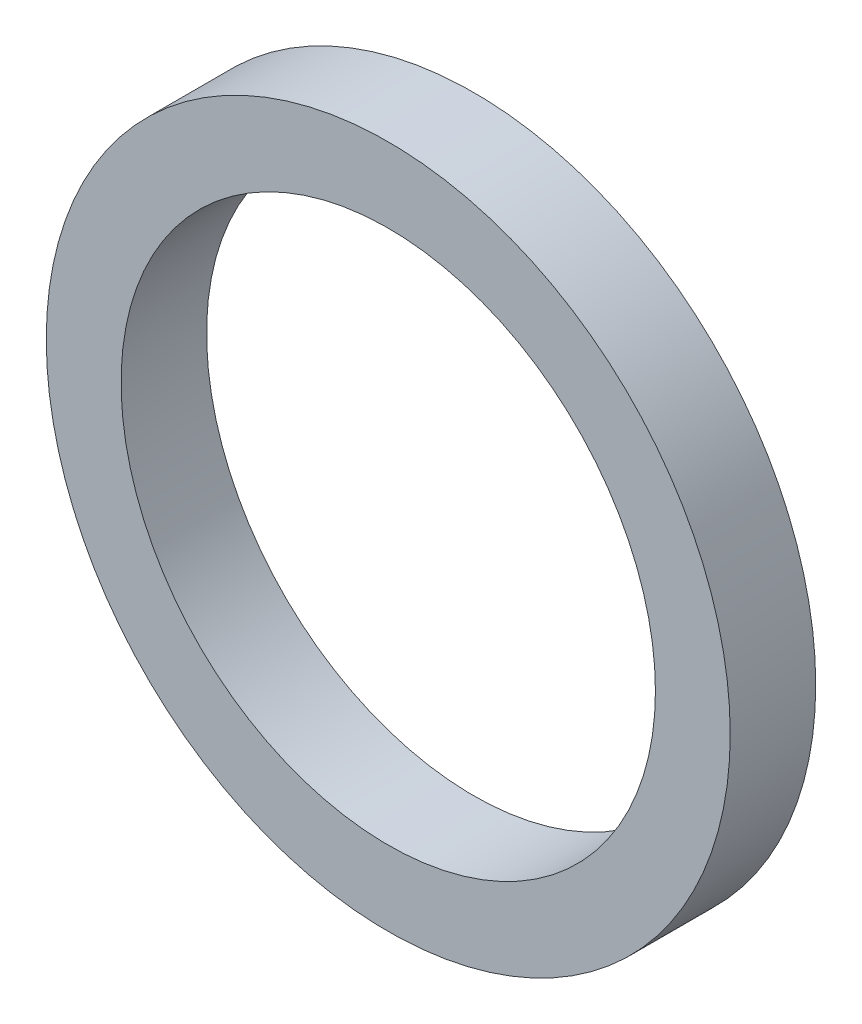
ISO-10303-21;
HEADER;
FILE_DESCRIPTION(('STEP AP214'),'2;1');
FILE_NAME('part.step','',(''),(''),'','','');
FILE_SCHEMA(('AUTOMOTIVE_DESIGN { 1 0 10303 214 1 1 1 1 }'));
ENDSEC;
DATA;
#1=APPLICATION_CONTEXT('core data for automotive mechanical design processes');
#2=APPLICATION_PROTOCOL_DEFINITION('international standard','automotive_design',2000,#1);
#3=PRODUCT_CONTEXT('',#1,'mechanical');
#4=PRODUCT('Part','Part','',(#3));
#5=PRODUCT_RELATED_PRODUCT_CATEGORY('part','',(#4));
#6=PRODUCT_DEFINITION_FORMATION('','',#4);
#7=PRODUCT_DEFINITION_CONTEXT('part definition',#1,'design');
#8=PRODUCT_DEFINITION('design','',#6,#7);
#9=PRODUCT_DEFINITION_SHAPE('','',#8);
#10=(LENGTH_UNIT() NAMED_UNIT(*) SI_UNIT(.MILLI.,.METRE.));
#11=(NAMED_UNIT(*) PLANE_ANGLE_UNIT() SI_UNIT($,.RADIAN.));
#12=(NAMED_UNIT(*) SI_UNIT($,.STERADIAN.) SOLID_ANGLE_UNIT());
#13=UNCERTAINTY_MEASURE_WITH_UNIT(LENGTH_MEASURE(1.E-05),#10,'distance_accuracy_value','');
#14=(GEOMETRIC_REPRESENTATION_CONTEXT(3) GLOBAL_UNCERTAINTY_ASSIGNED_CONTEXT((#13)) GLOBAL_UNIT_ASSIGNED_CONTEXT((#10,
#11,#12)) REPRESENTATION_CONTEXT('',''));
#15=CARTESIAN_POINT('',(0.,0.,0.));
#16=DIRECTION('',(0.,0.,1.));
#17=DIRECTION('',(1.,0.,0.));
#18=AXIS2_PLACEMENT_3D('',#15,#16,#17);
#19=CARTESIAN_POINT('',(0.,0.,4.));
#20=DIRECTION('',(0.,0.,1.));
#21=DIRECTION('',(1.,0.,0.));
#22=AXIS2_PLACEMENT_3D('',#19,#20,#21);
#23=PLANE('',#22);
#24=CARTESIAN_POINT('',(0.,0.,4.));
#25=DIRECTION('',(0.,0.,1.));
#26=DIRECTION('',(1.,0.,0.));
#27=AXIS2_PLACEMENT_3D('',#24,#25,#26);
#28=CIRCLE('',#27,16.);
#29=CARTESIAN_POINT('',(16.,0.,4.));
#30=VERTEX_POINT('',#29);
#31=EDGE_CURVE('E10',#30,#30,#28,.T.);
#32=ORIENTED_EDGE('',*,*,#31,.T.);
#33=EDGE_LOOP('',(#32));
#34=FACE_BOUND('',#33,.T.);
#35=CARTESIAN_POINT('',(0.,0.,4.));
#36=DIRECTION('',(0.,0.,1.));
#37=DIRECTION('',(1.,0.,0.));
#38=AXIS2_PLACEMENT_3D('',#35,#36,#37);
#39=CIRCLE('',#38,12.5);
#40=CARTESIAN_POINT('',(12.5,0.,4.));
#41=VERTEX_POINT('',#40);
#42=EDGE_CURVE('E50',#41,#41,#39,.T.);
#43=ORIENTED_EDGE('',*,*,#42,.F.);
#44=EDGE_LOOP('',(#43));
#45=FACE_BOUND('',#44,.T.);
#46=ADVANCED_FACE('F37',(#34,#45),#23,.T.);
#47=CARTESIAN_POINT('',(0.,0.,0.));
#48=DIRECTION('',(0.,0.,1.));
#49=DIRECTION('',(1.,0.,0.));
#50=AXIS2_PLACEMENT_3D('',#47,#48,#49);
#51=PLANE('',#50);
#52=CARTESIAN_POINT('',(0.,0.,0.));
#53=DIRECTION('',(0.,0.,1.));
#54=DIRECTION('',(1.,0.,0.));
#55=AXIS2_PLACEMENT_3D('',#52,#53,#54);
#56=CIRCLE('',#55,16.);
#57=CARTESIAN_POINT('',(16.,0.,0.));
#58=VERTEX_POINT('',#57);
#59=EDGE_CURVE('E41',#58,#58,#56,.T.);
#60=ORIENTED_EDGE('',*,*,#59,.F.);
#61=EDGE_LOOP('',(#60));
#62=FACE_BOUND('',#61,.T.);
#63=CARTESIAN_POINT('',(0.,0.,0.));
#64=DIRECTION('',(0.,0.,1.));
#65=DIRECTION('',(1.,0.,0.));
#66=AXIS2_PLACEMENT_3D('',#63,#64,#65);
#67=CIRCLE('',#66,12.5);
#68=CARTESIAN_POINT('',(12.5,0.,0.));
#69=VERTEX_POINT('',#68);
#70=EDGE_CURVE('E52',#69,#69,#67,.T.);
#71=ORIENTED_EDGE('',*,*,#70,.T.);
#72=EDGE_LOOP('',(#71));
#73=FACE_BOUND('',#72,.T.);
#74=ADVANCED_FACE('F64',(#62,#73),#51,.F.);
#75=CARTESIAN_POINT('',(0.,0.,4.));
#76=DIRECTION('',(0.,0.,-1.));
#77=DIRECTION('',(-1.,0.,0.));
#78=AXIS2_PLACEMENT_3D('',#75,#76,#77);
#79=CYLINDRICAL_SURFACE('',#78,16.);
#80=ORIENTED_EDGE('',*,*,#31,.F.);
#81=EDGE_LOOP('',(#80));
#82=FACE_BOUND('',#81,.T.);
#83=ORIENTED_EDGE('',*,*,#59,.T.);
#84=EDGE_LOOP('',(#83));
#85=FACE_BOUND('',#84,.T.);
#86=ADVANCED_FACE('F39',(#82,#85),#79,.T.);
#87=CARTESIAN_POINT('',(0.,0.,4.));
#88=DIRECTION('',(0.,0.,-1.));
#89=DIRECTION('',(-1.,0.,0.));
#90=AXIS2_PLACEMENT_3D('',#87,#88,#89);
#91=CYLINDRICAL_SURFACE('',#90,12.5);
#92=ORIENTED_EDGE('',*,*,#42,.T.);
#93=EDGE_LOOP('',(#92));
#94=FACE_BOUND('',#93,.T.);
#95=ORIENTED_EDGE('',*,*,#70,.F.);
#96=EDGE_LOOP('',(#95));
#97=FACE_BOUND('',#96,.T.);
#98=ADVANCED_FACE('F60',(#94,#97),#91,.F.);
#99=CLOSED_SHELL('',(#46,#74,#86,#98));
#100=MANIFOLD_SOLID_BREP('B2',#99);
#101=ADVANCED_BREP_SHAPE_REPRESENTATION('',(#18,#100),#14);
#102=SHAPE_DEFINITION_REPRESENTATION(#9,#101);
ENDSEC;
END-ISO-10303-21;
